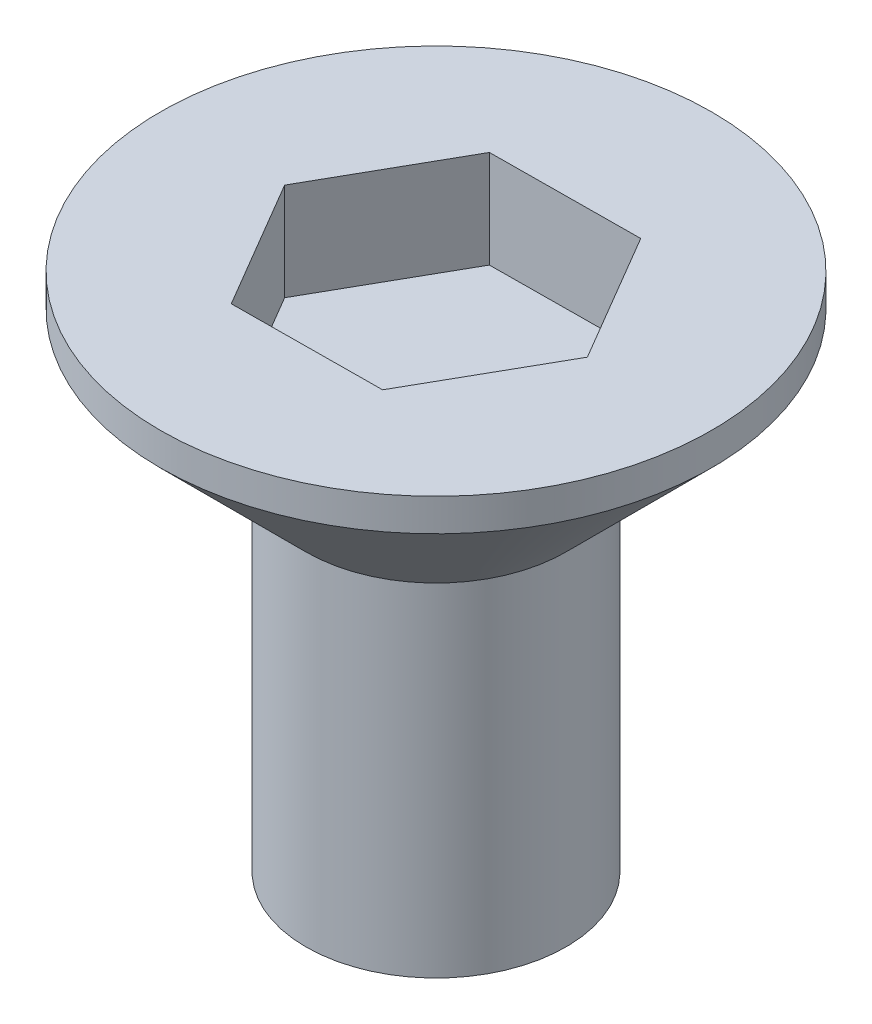
ISO-10303-21;
HEADER;
FILE_DESCRIPTION(('STEP AP214'),'2;1');
FILE_NAME('part.step','',(''),(''),'','','');
FILE_SCHEMA(('AUTOMOTIVE_DESIGN { 1 0 10303 214 1 1 1 1 }'));
ENDSEC;
DATA;
#1=APPLICATION_CONTEXT('core data for automotive mechanical design processes');
#2=APPLICATION_PROTOCOL_DEFINITION('international standard','automotive_design',2000,#1);
#3=PRODUCT_CONTEXT('',#1,'mechanical');
#4=PRODUCT('Part','Part','',(#3));
#5=PRODUCT_RELATED_PRODUCT_CATEGORY('part','',(#4));
#6=PRODUCT_DEFINITION_FORMATION('','',#4);
#7=PRODUCT_DEFINITION_CONTEXT('part definition',#1,'design');
#8=PRODUCT_DEFINITION('design','',#6,#7);
#9=PRODUCT_DEFINITION_SHAPE('','',#8);
#10=(LENGTH_UNIT() NAMED_UNIT(*) SI_UNIT(.MILLI.,.METRE.));
#11=(NAMED_UNIT(*) PLANE_ANGLE_UNIT() SI_UNIT($,.RADIAN.));
#12=(NAMED_UNIT(*) SI_UNIT($,.STERADIAN.) SOLID_ANGLE_UNIT());
#13=UNCERTAINTY_MEASURE_WITH_UNIT(LENGTH_MEASURE(1.E-05),#10,'distance_accuracy_value','');
#14=(GEOMETRIC_REPRESENTATION_CONTEXT(3) GLOBAL_UNCERTAINTY_ASSIGNED_CONTEXT((#13)) GLOBAL_UNIT_ASSIGNED_CONTEXT((#10,
#11,#12)) REPRESENTATION_CONTEXT('',''));
#15=CARTESIAN_POINT('',(0.,0.,0.));
#16=DIRECTION('',(0.,0.,1.));
#17=DIRECTION('',(1.,0.,0.));
#18=AXIS2_PLACEMENT_3D('',#15,#16,#17);
#19=CARTESIAN_POINT('',(0.,0.,0.));
#20=DIRECTION('',(0.,1.,0.));
#21=DIRECTION('',(0.,0.,1.));
#22=AXIS2_PLACEMENT_3D('',#19,#20,#21);
#23=PLANE('',#22);
#24=CARTESIAN_POINT('',(0.,0.,0.));
#25=DIRECTION('',(0.,1.,0.));
#26=DIRECTION('',(0.,0.,1.));
#27=AXIS2_PLACEMENT_3D('',#24,#25,#26);
#28=CIRCLE('',#27,4.);
#29=CARTESIAN_POINT('',(0.,0.,4.));
#30=VERTEX_POINT('',#29);
#31=EDGE_CURVE('E11',#30,#30,#28,.T.);
#32=ORIENTED_EDGE('',*,*,#31,.F.);
#33=EDGE_LOOP('',(#32));
#34=FACE_BOUND('',#33,.T.);
#35=ADVANCED_FACE('F35',(#34),#23,.F.);
#36=CARTESIAN_POINT('',(0.,68.6445759886598,0.));
#37=DIRECTION('',(0.,1.,0.));
#38=DIRECTION('',(0.,0.,1.));
#39=AXIS2_PLACEMENT_3D('',#36,#37,#38);
#40=CYLINDRICAL_SURFACE('',#39,4.);
#41=CARTESIAN_POINT('',(0.,10.5194314445393,0.));
#42=DIRECTION('',(0.,1.,0.));
#43=DIRECTION('',(0.,0.,1.));
#44=AXIS2_PLACEMENT_3D('',#41,#42,#43);
#45=CIRCLE('',#44,4.);
#46=CARTESIAN_POINT('',(0.,10.5194314445393,4.));
#47=VERTEX_POINT('',#46);
#48=EDGE_CURVE('E42',#47,#47,#45,.T.);
#49=ORIENTED_EDGE('',*,*,#48,.F.);
#50=EDGE_LOOP('',(#49));
#51=FACE_BOUND('',#50,.T.);
#52=ORIENTED_EDGE('',*,*,#31,.T.);
#53=EDGE_LOOP('',(#52));
#54=FACE_BOUND('',#53,.T.);
#55=ADVANCED_FACE('F151',(#51,#54),#40,.T.);
#56=CARTESIAN_POINT('',(0.,10.5194314445393,0.));
#57=DIRECTION('',(0.,1.,0.));
#58=DIRECTION('',(0.,0.,1.));
#59=AXIS2_PLACEMENT_3D('',#56,#57,#58);
#60=CONICAL_SURFACE('',#59,4.,0.785398163397446);
#61=CARTESIAN_POINT('',(0.,15.,0.));
#62=DIRECTION('',(0.,1.,0.));
#63=DIRECTION('',(0.,0.,1.));
#64=AXIS2_PLACEMENT_3D('',#61,#62,#63);
#65=CIRCLE('',#64,8.48056855546072);
#66=CARTESIAN_POINT('',(0.,15.,8.48056855546072));
#67=VERTEX_POINT('',#66);
#68=EDGE_CURVE('E144',#67,#67,#65,.T.);
#69=ORIENTED_EDGE('',*,*,#68,.F.);
#70=EDGE_LOOP('',(#69));
#71=FACE_BOUND('',#70,.T.);
#72=ORIENTED_EDGE('',*,*,#48,.T.);
#73=EDGE_LOOP('',(#72));
#74=FACE_BOUND('',#73,.T.);
#75=ADVANCED_FACE('F149',(#71,#74),#60,.T.);
#76=CARTESIAN_POINT('',(0.,68.6445759886598,0.));
#77=DIRECTION('',(0.,1.,0.));
#78=DIRECTION('',(0.,0.,1.));
#79=AXIS2_PLACEMENT_3D('',#76,#77,#78);
#80=CYLINDRICAL_SURFACE('',#79,8.48056855546072);
#81=CARTESIAN_POINT('',(0.,16.,0.));
#82=DIRECTION('',(0.,1.,0.));
#83=DIRECTION('',(0.,0.,1.));
#84=AXIS2_PLACEMENT_3D('',#81,#82,#83);
#85=CIRCLE('',#84,8.48056855546072);
#86=CARTESIAN_POINT('',(0.,16.,8.48056855546072));
#87=VERTEX_POINT('',#86);
#88=EDGE_CURVE('E136',#87,#87,#85,.T.);
#89=ORIENTED_EDGE('',*,*,#88,.F.);
#90=EDGE_LOOP('',(#89));
#91=FACE_BOUND('',#90,.T.);
#92=ORIENTED_EDGE('',*,*,#68,.T.);
#93=EDGE_LOOP('',(#92));
#94=FACE_BOUND('',#93,.T.);
#95=ADVANCED_FACE('F169',(#91,#94),#80,.T.);
#96=CARTESIAN_POINT('',(8.48056855546072,16.,0.));
#97=DIRECTION('',(0.,-1.,0.));
#98=DIRECTION('',(0.,0.,-1.));
#99=AXIS2_PLACEMENT_3D('',#96,#97,#98);
#100=PLANE('',#99);
#101=DIRECTION('',(0.493268448593922,0.,-0.869877139383342));
#102=VECTOR('',#101,1.);
#103=CARTESIAN_POINT('',(2.34035387121957,16.,3.98196899671519));
#104=LINE('',#103,#102);
#105=CARTESIAN_POINT('',(2.34035387121957,16.,3.98196899671519));
#106=VERTEX_POINT('',#105);
#107=CARTESIAN_POINT('',(4.61866324384717,16.,-0.035821407963807));
#108=VERTEX_POINT('',#107);
#109=EDGE_CURVE('E123',#106,#108,#104,.T.);
#110=ORIENTED_EDGE('',*,*,#109,.F.);
#111=DIRECTION('',(0.999969925174272,0.,-0.00775556232399538));
#112=VECTOR('',#111,1.);
#113=CARTESIAN_POINT('',(-2.2783093726276,16.,4.01779040467899));
#114=LINE('',#113,#112);
#115=CARTESIAN_POINT('',(-2.2783093726276,16.,4.01779040467899));
#116=VERTEX_POINT('',#115);
#117=EDGE_CURVE('E49',#116,#106,#114,.T.);
#118=ORIENTED_EDGE('',*,*,#117,.F.);
#119=DIRECTION('',(0.50670147658035,0.,0.862121577059346));
#120=VECTOR('',#119,1.);
#121=CARTESIAN_POINT('',(-4.61866324384717,16.,0.0358214079638057));
#122=LINE('',#121,#120);
#123=CARTESIAN_POINT('',(-4.61866324384717,16.,0.0358214079638057));
#124=VERTEX_POINT('',#123);
#125=EDGE_CURVE('E132',#124,#116,#122,.T.);
#126=ORIENTED_EDGE('',*,*,#125,.F.);
#127=DIRECTION('',(-0.493268448593922,0.,0.869877139383341));
#128=VECTOR('',#127,1.);
#129=CARTESIAN_POINT('',(-2.34035387121957,16.,-3.98196899671519));
#130=LINE('',#129,#128);
#131=CARTESIAN_POINT('',(-2.34035387121957,16.,-3.98196899671519));
#132=VERTEX_POINT('',#131);
#133=EDGE_CURVE('E130',#132,#124,#130,.T.);
#134=ORIENTED_EDGE('',*,*,#133,.F.);
#135=DIRECTION('',(-0.999969925174272,0.,0.00775556232399538));
#136=VECTOR('',#135,1.);
#137=CARTESIAN_POINT('',(2.2783093726276,16.,-4.01779040467899));
#138=LINE('',#137,#136);
#139=CARTESIAN_POINT('',(2.2783093726276,16.,-4.01779040467899));
#140=VERTEX_POINT('',#139);
#141=EDGE_CURVE('E97',#140,#132,#138,.T.);
#142=ORIENTED_EDGE('',*,*,#141,.F.);
#143=DIRECTION('',(-0.506701476580349,0.,-0.862121577059346));
#144=VECTOR('',#143,1.);
#145=CARTESIAN_POINT('',(4.61866324384717,16.,-0.035821407963807));
#146=LINE('',#145,#144);
#147=EDGE_CURVE('E126',#108,#140,#146,.T.);
#148=ORIENTED_EDGE('',*,*,#147,.F.);
#149=EDGE_LOOP('',(#110,#118,#126,#134,#142,#148));
#150=FACE_BOUND('',#149,.T.);
#151=ORIENTED_EDGE('',*,*,#88,.T.);
#152=EDGE_LOOP('',(#151));
#153=FACE_BOUND('',#152,.T.);
#154=ADVANCED_FACE('F177',(#150,#153),#100,.F.);
#155=CARTESIAN_POINT('',(-2.2783093726276,13.,4.01779040467899));
#156=DIRECTION('',(0.00775556232399537,0.,0.999969925174272));
#157=DIRECTION('',(0.999969925174272,0.,-0.00775556232399538));
#158=AXIS2_PLACEMENT_3D('',#155,#156,#157);
#159=PLANE('',#158);
#160=ORIENTED_EDGE('',*,*,#117,.T.);
#161=DIRECTION('',(0.,1.,0.));
#162=VECTOR('',#161,1.);
#163=CARTESIAN_POINT('',(2.34035387121957,13.,3.98196899671519));
#164=LINE('',#163,#162);
#165=CARTESIAN_POINT('',(2.34035387121957,13.,3.98196899671519));
#166=VERTEX_POINT('',#165);
#167=EDGE_CURVE('E79',#166,#106,#164,.T.);
#168=ORIENTED_EDGE('',*,*,#167,.F.);
#169=DIRECTION('',(0.999969925174272,0.,-0.00775556232399538));
#170=VECTOR('',#169,1.);
#171=CARTESIAN_POINT('',(-2.2783093726276,13.,4.01779040467899));
#172=LINE('',#171,#170);
#173=CARTESIAN_POINT('',(-2.2783093726276,13.,4.01779040467899));
#174=VERTEX_POINT('',#173);
#175=EDGE_CURVE('E134',#174,#166,#172,.T.);
#176=ORIENTED_EDGE('',*,*,#175,.F.);
#177=DIRECTION('',(0.,1.,0.));
#178=VECTOR('',#177,1.);
#179=CARTESIAN_POINT('',(-2.2783093726276,13.,4.01779040467899));
#180=LINE('',#179,#178);
#181=EDGE_CURVE('E57',#174,#116,#180,.T.);
#182=ORIENTED_EDGE('',*,*,#181,.T.);
#183=EDGE_LOOP('',(#160,#168,#176,#182));
#184=FACE_BOUND('',#183,.T.);
#185=ADVANCED_FACE('F185',(#184),#159,.F.);
#186=CARTESIAN_POINT('',(-4.61866324384717,13.,0.0358214079638057));
#187=DIRECTION('',(-0.862121577059346,0.,0.50670147658035));
#188=DIRECTION('',(0.50670147658035,0.,0.862121577059346));
#189=AXIS2_PLACEMENT_3D('',#186,#187,#188);
#190=PLANE('',#189);
#191=ORIENTED_EDGE('',*,*,#125,.T.);
#192=ORIENTED_EDGE('',*,*,#181,.F.);
#193=DIRECTION('',(0.50670147658035,0.,0.862121577059346));
#194=VECTOR('',#193,1.);
#195=CARTESIAN_POINT('',(-4.61866324384717,13.,0.0358214079638057));
#196=LINE('',#195,#194);
#197=CARTESIAN_POINT('',(-4.61866324384717,13.,0.0358214079638057));
#198=VERTEX_POINT('',#197);
#199=EDGE_CURVE('E109',#198,#174,#196,.T.);
#200=ORIENTED_EDGE('',*,*,#199,.F.);
#201=DIRECTION('',(0.,1.,0.));
#202=VECTOR('',#201,1.);
#203=CARTESIAN_POINT('',(-4.61866324384717,13.,0.0358214079638057));
#204=LINE('',#203,#202);
#205=EDGE_CURVE('E101',#198,#124,#204,.T.);
#206=ORIENTED_EDGE('',*,*,#205,.T.);
#207=EDGE_LOOP('',(#191,#192,#200,#206));
#208=FACE_BOUND('',#207,.T.);
#209=ADVANCED_FACE('F193',(#208),#190,.F.);
#210=CARTESIAN_POINT('',(-2.34035387121957,13.,-3.98196899671519));
#211=DIRECTION('',(-0.869877139383341,0.,-0.493268448593922));
#212=DIRECTION('',(-0.493268448593922,0.,0.869877139383342));
#213=AXIS2_PLACEMENT_3D('',#210,#211,#212);
#214=PLANE('',#213);
#215=ORIENTED_EDGE('',*,*,#133,.T.);
#216=ORIENTED_EDGE('',*,*,#205,.F.);
#217=DIRECTION('',(-0.493268448593922,0.,0.869877139383341));
#218=VECTOR('',#217,1.);
#219=CARTESIAN_POINT('',(-2.34035387121957,13.,-3.98196899671519));
#220=LINE('',#219,#218);
#221=CARTESIAN_POINT('',(-2.34035387121957,13.,-3.98196899671519));
#222=VERTEX_POINT('',#221);
#223=EDGE_CURVE('E105',#222,#198,#220,.T.);
#224=ORIENTED_EDGE('',*,*,#223,.F.);
#225=DIRECTION('',(0.,1.,0.));
#226=VECTOR('',#225,1.);
#227=CARTESIAN_POINT('',(-2.34035387121957,13.,-3.98196899671519));
#228=LINE('',#227,#226);
#229=EDGE_CURVE('E90',#222,#132,#228,.T.);
#230=ORIENTED_EDGE('',*,*,#229,.T.);
#231=EDGE_LOOP('',(#215,#216,#224,#230));
#232=FACE_BOUND('',#231,.T.);
#233=ADVANCED_FACE('F106',(#232),#214,.F.);
#234=CARTESIAN_POINT('',(2.2783093726276,13.,-4.01779040467899));
#235=DIRECTION('',(-0.00775556232399538,0.,-0.999969925174272));
#236=DIRECTION('',(-0.999969925174272,0.,0.00775556232399538));
#237=AXIS2_PLACEMENT_3D('',#234,#235,#236);
#238=PLANE('',#237);
#239=ORIENTED_EDGE('',*,*,#141,.T.);
#240=ORIENTED_EDGE('',*,*,#229,.F.);
#241=DIRECTION('',(-0.999969925174272,0.,0.00775556232399538));
#242=VECTOR('',#241,1.);
#243=CARTESIAN_POINT('',(2.2783093726276,13.,-4.01779040467899));
#244=LINE('',#243,#242);
#245=CARTESIAN_POINT('',(2.2783093726276,13.,-4.01779040467899));
#246=VERTEX_POINT('',#245);
#247=EDGE_CURVE('E94',#246,#222,#244,.T.);
#248=ORIENTED_EDGE('',*,*,#247,.F.);
#249=DIRECTION('',(0.,1.,0.));
#250=VECTOR('',#249,1.);
#251=CARTESIAN_POINT('',(2.2783093726276,13.,-4.01779040467899));
#252=LINE('',#251,#250);
#253=EDGE_CURVE('E102',#246,#140,#252,.T.);
#254=ORIENTED_EDGE('',*,*,#253,.T.);
#255=EDGE_LOOP('',(#239,#240,#248,#254));
#256=FACE_BOUND('',#255,.T.);
#257=ADVANCED_FACE('F92',(#256),#238,.F.);
#258=CARTESIAN_POINT('',(4.61866324384717,13.,-0.035821407963807));
#259=DIRECTION('',(0.862121577059346,0.,-0.506701476580349));
#260=DIRECTION('',(-0.506701476580349,0.,-0.862121577059346));
#261=AXIS2_PLACEMENT_3D('',#258,#259,#260);
#262=PLANE('',#261);
#263=ORIENTED_EDGE('',*,*,#147,.T.);
#264=ORIENTED_EDGE('',*,*,#253,.F.);
#265=DIRECTION('',(-0.506701476580349,0.,-0.862121577059346));
#266=VECTOR('',#265,1.);
#267=CARTESIAN_POINT('',(4.61866324384717,13.,-0.035821407963807));
#268=LINE('',#267,#266);
#269=CARTESIAN_POINT('',(4.61866324384717,13.,-0.035821407963807));
#270=VERTEX_POINT('',#269);
#271=EDGE_CURVE('E115',#270,#246,#268,.T.);
#272=ORIENTED_EDGE('',*,*,#271,.F.);
#273=DIRECTION('',(0.,1.,0.));
#274=VECTOR('',#273,1.);
#275=CARTESIAN_POINT('',(4.61866324384717,13.,-0.035821407963807));
#276=LINE('',#275,#274);
#277=EDGE_CURVE('E139',#270,#108,#276,.T.);
#278=ORIENTED_EDGE('',*,*,#277,.T.);
#279=EDGE_LOOP('',(#263,#264,#272,#278));
#280=FACE_BOUND('',#279,.T.);
#281=ADVANCED_FACE('F212',(#280),#262,.F.);
#282=CARTESIAN_POINT('',(2.34035387121957,13.,3.98196899671519));
#283=DIRECTION('',(0.869877139383341,0.,0.493268448593922));
#284=DIRECTION('',(0.493268448593922,0.,-0.869877139383342));
#285=AXIS2_PLACEMENT_3D('',#282,#283,#284);
#286=PLANE('',#285);
#287=ORIENTED_EDGE('',*,*,#109,.T.);
#288=ORIENTED_EDGE('',*,*,#277,.F.);
#289=DIRECTION('',(0.493268448593922,0.,-0.869877139383342));
#290=VECTOR('',#289,1.);
#291=CARTESIAN_POINT('',(2.34035387121957,13.,3.98196899671519));
#292=LINE('',#291,#290);
#293=EDGE_CURVE('E117',#166,#270,#292,.T.);
#294=ORIENTED_EDGE('',*,*,#293,.F.);
#295=ORIENTED_EDGE('',*,*,#167,.T.);
#296=EDGE_LOOP('',(#287,#288,#294,#295));
#297=FACE_BOUND('',#296,.T.);
#298=ADVANCED_FACE('F219',(#297),#286,.F.);
#299=CARTESIAN_POINT('',(0.,13.,0.));
#300=DIRECTION('',(0.,1.,0.));
#301=DIRECTION('',(0.,0.,1.));
#302=AXIS2_PLACEMENT_3D('',#299,#300,#301);
#303=PLANE('',#302);
#304=ORIENTED_EDGE('',*,*,#175,.T.);
#305=ORIENTED_EDGE('',*,*,#293,.T.);
#306=ORIENTED_EDGE('',*,*,#271,.T.);
#307=ORIENTED_EDGE('',*,*,#247,.T.);
#308=ORIENTED_EDGE('',*,*,#223,.T.);
#309=ORIENTED_EDGE('',*,*,#199,.T.);
#310=EDGE_LOOP('',(#304,#305,#306,#307,#308,#309));
#311=FACE_BOUND('',#310,.T.);
#312=ADVANCED_FACE('F112',(#311),#303,.T.);
#313=CLOSED_SHELL('',(#35,#55,#75,#95,#154,#185,#209,#233,#257,#281,#298,#312));
#314=MANIFOLD_SOLID_BREP('B2',#313);
#315=ADVANCED_BREP_SHAPE_REPRESENTATION('',(#18,#314),#14);
#316=SHAPE_DEFINITION_REPRESENTATION(#9,#315);
ENDSEC;
END-ISO-10303-21;
